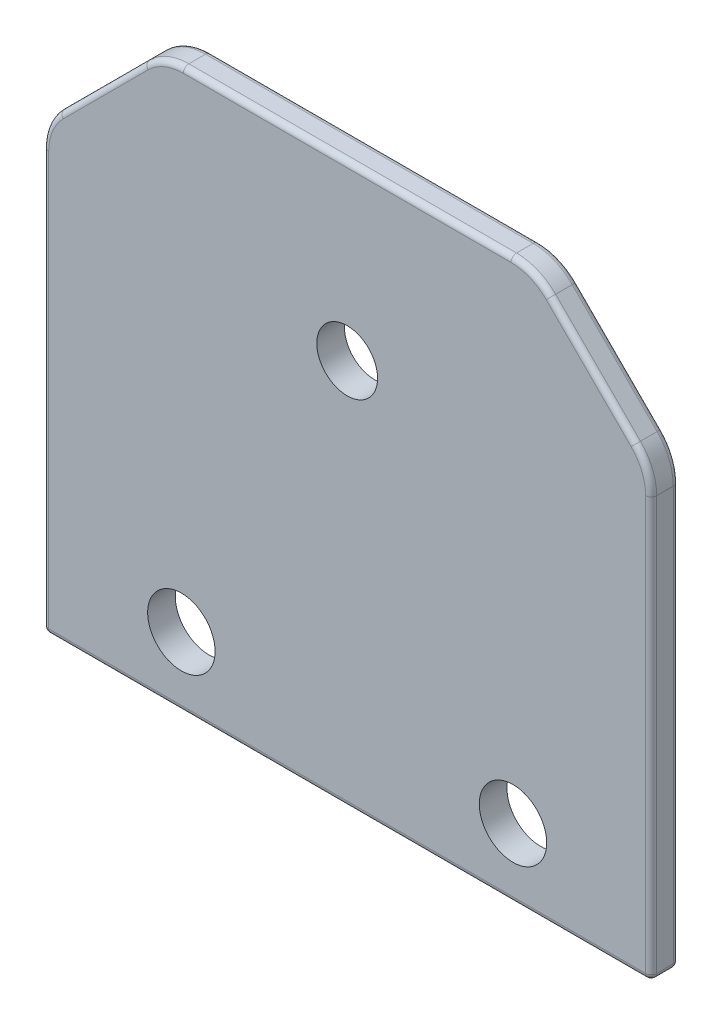
ISO-10303-21;
HEADER;
FILE_DESCRIPTION(('STEP AP214'),'2;1');
FILE_NAME('part.step','',(''),(''),'','','');
FILE_SCHEMA(('AUTOMOTIVE_DESIGN { 1 0 10303 214 1 1 1 1 }'));
ENDSEC;
DATA;
#1=APPLICATION_CONTEXT('core data for automotive mechanical design processes');
#2=APPLICATION_PROTOCOL_DEFINITION('international standard','automotive_design',2000,#1);
#3=PRODUCT_CONTEXT('',#1,'mechanical');
#4=PRODUCT('Part','Part','',(#3));
#5=PRODUCT_RELATED_PRODUCT_CATEGORY('part','',(#4));
#6=PRODUCT_DEFINITION_FORMATION('','',#4);
#7=PRODUCT_DEFINITION_CONTEXT('part definition',#1,'design');
#8=PRODUCT_DEFINITION('design','',#6,#7);
#9=PRODUCT_DEFINITION_SHAPE('','',#8);
#10=(LENGTH_UNIT() NAMED_UNIT(*) SI_UNIT(.MILLI.,.METRE.));
#11=(NAMED_UNIT(*) PLANE_ANGLE_UNIT() SI_UNIT($,.RADIAN.));
#12=(NAMED_UNIT(*) SI_UNIT($,.STERADIAN.) SOLID_ANGLE_UNIT());
#13=UNCERTAINTY_MEASURE_WITH_UNIT(LENGTH_MEASURE(1.E-05),#10,'distance_accuracy_value','');
#14=(GEOMETRIC_REPRESENTATION_CONTEXT(3) GLOBAL_UNCERTAINTY_ASSIGNED_CONTEXT((#13)) GLOBAL_UNIT_ASSIGNED_CONTEXT((#10,
#11,#12)) REPRESENTATION_CONTEXT('',''));
#15=CARTESIAN_POINT('',(0.,0.,0.));
#16=DIRECTION('',(0.,0.,1.));
#17=DIRECTION('',(1.,0.,0.));
#18=AXIS2_PLACEMENT_3D('',#15,#16,#17);
#19=CARTESIAN_POINT('',(94.9999999999994,95.0000000000005,5.));
#20=DIRECTION('',(-0.707106781186543,-0.707106781186552,0.));
#21=DIRECTION('',(0.707106781186552,-0.707106781186543,0.));
#22=AXIS2_PLACEMENT_3D('',#19,#20,#21);
#23=PLANE('',#22);
#24=DIRECTION('',(0.,0.,-1.));
#25=VECTOR('',#24,1.);
#26=CARTESIAN_POINT('',(107.071067811865,82.9289321881345,5.));
#27=LINE('',#26,#25);
#28=CARTESIAN_POINT('',(107.071067811865,82.9289321881345,4.));
#29=VERTEX_POINT('',#28);
#30=CARTESIAN_POINT('',(107.071067811865,82.9289321881345,1.));
#31=VERTEX_POINT('',#30);
#32=EDGE_CURVE('E234',#29,#31,#27,.T.);
#33=ORIENTED_EDGE('',*,*,#32,.T.);
#34=DIRECTION('',(-0.707106781186552,0.707106781186543,0.));
#35=VECTOR('',#34,1.);
#36=CARTESIAN_POINT('',(94.9999999999994,95.0000000000005,1.));
#37=LINE('',#36,#35);
#38=CARTESIAN_POINT('',(91.7157287525378,98.284271247462,1.));
#39=VERTEX_POINT('',#38);
#40=EDGE_CURVE('E276',#31,#39,#37,.T.);
#41=ORIENTED_EDGE('',*,*,#40,.T.);
#42=DIRECTION('',(0.,0.,-1.));
#43=VECTOR('',#42,1.);
#44=CARTESIAN_POINT('',(91.7157287525378,98.284271247462,5.));
#45=LINE('',#44,#43);
#46=CARTESIAN_POINT('',(91.7157287525378,98.284271247462,4.));
#47=VERTEX_POINT('',#46);
#48=EDGE_CURVE('E239',#39,#47,#45,.F.);
#49=ORIENTED_EDGE('',*,*,#48,.T.);
#50=DIRECTION('',(-0.707106781186552,0.707106781186543,0.));
#51=VECTOR('',#50,1.);
#52=CARTESIAN_POINT('',(107.071067811865,82.9289321881345,4.));
#53=LINE('',#52,#51);
#54=EDGE_CURVE('E218',#47,#29,#53,.F.);
#55=ORIENTED_EDGE('',*,*,#54,.T.);
#56=EDGE_LOOP('',(#33,#41,#49,#55));
#57=FACE_BOUND('',#56,.T.);
#58=ADVANCED_FACE('F45',(#57),#23,.F.);
#59=CARTESIAN_POINT('',(0.,101.213203435596,5.));
#60=DIRECTION('',(0.,-1.,0.));
#61=DIRECTION('',(1.,0.,0.));
#62=AXIS2_PLACEMENT_3D('',#59,#60,#61);
#63=PLANE('',#62);
#64=DIRECTION('',(0.,0.,-1.));
#65=VECTOR('',#64,1.);
#66=CARTESIAN_POINT('',(84.6446609406724,101.213203435596,5.));
#67=LINE('',#66,#65);
#68=CARTESIAN_POINT('',(84.6446609406724,101.213203435596,4.));
#69=VERTEX_POINT('',#68);
#70=CARTESIAN_POINT('',(84.6446609406724,101.213203435596,1.));
#71=VERTEX_POINT('',#70);
#72=EDGE_CURVE('E237',#69,#71,#67,.T.);
#73=ORIENTED_EDGE('',*,*,#72,.T.);
#74=DIRECTION('',(-1.,0.,0.));
#75=VECTOR('',#74,1.);
#76=CARTESIAN_POINT('',(0.,101.213203435596,1.));
#77=LINE('',#76,#75);
#78=CARTESIAN_POINT('',(25.3553390593273,101.213203435596,1.));
#79=VERTEX_POINT('',#78);
#80=EDGE_CURVE('E11',#71,#79,#77,.T.);
#81=ORIENTED_EDGE('',*,*,#80,.T.);
#82=DIRECTION('',(0.,0.,-1.));
#83=VECTOR('',#82,1.);
#84=CARTESIAN_POINT('',(25.3553390593273,101.213203435596,5.));
#85=LINE('',#84,#83);
#86=CARTESIAN_POINT('',(25.3553390593273,101.213203435596,4.));
#87=VERTEX_POINT('',#86);
#88=EDGE_CURVE('E233',#79,#87,#85,.F.);
#89=ORIENTED_EDGE('',*,*,#88,.T.);
#90=DIRECTION('',(-1.,0.,0.));
#91=VECTOR('',#90,1.);
#92=CARTESIAN_POINT('',(84.6446609406724,101.213203435596,4.));
#93=LINE('',#92,#91);
#94=EDGE_CURVE('E54',#87,#69,#93,.F.);
#95=ORIENTED_EDGE('',*,*,#94,.T.);
#96=EDGE_LOOP('',(#73,#81,#89,#95));
#97=FACE_BOUND('',#96,.T.);
#98=ADVANCED_FACE('F455',(#97),#63,.F.);
#99=CARTESIAN_POINT('',(-40.,39.9999999999998,5.));
#100=DIRECTION('',(-0.707106781186549,0.707106781186546,0.));
#101=DIRECTION('',(-0.707106781186546,-0.707106781186549,0.));
#102=AXIS2_PLACEMENT_3D('',#99,#100,#101);
#103=PLANE('',#102);
#104=DIRECTION('',(0.,0.,-1.));
#105=VECTOR('',#104,1.);
#106=CARTESIAN_POINT('',(18.2842712474619,98.2842712474619,0.));
#107=LINE('',#106,#105);
#108=CARTESIAN_POINT('',(18.2842712474619,98.2842712474619,4.));
#109=VERTEX_POINT('',#108);
#110=CARTESIAN_POINT('',(18.2842712474619,98.2842712474619,1.));
#111=VERTEX_POINT('',#110);
#112=EDGE_CURVE('E248',#109,#111,#107,.T.);
#113=ORIENTED_EDGE('',*,*,#112,.T.);
#114=DIRECTION('',(0.707106781186546,0.707106781186549,0.));
#115=VECTOR('',#114,1.);
#116=CARTESIAN_POINT('',(2.92893218813452,82.9289321881345,1.));
#117=LINE('',#116,#115);
#118=CARTESIAN_POINT('',(2.92893218813452,82.9289321881345,1.));
#119=VERTEX_POINT('',#118);
#120=EDGE_CURVE('E294',#111,#119,#117,.F.);
#121=ORIENTED_EDGE('',*,*,#120,.T.);
#122=DIRECTION('',(0.,0.,-1.));
#123=VECTOR('',#122,1.);
#124=CARTESIAN_POINT('',(2.92893218813452,82.9289321881345,5.));
#125=LINE('',#124,#123);
#126=CARTESIAN_POINT('',(2.92893218813452,82.9289321881345,4.));
#127=VERTEX_POINT('',#126);
#128=EDGE_CURVE('E251',#119,#127,#125,.F.);
#129=ORIENTED_EDGE('',*,*,#128,.T.);
#130=DIRECTION('',(0.707106781186546,0.707106781186549,0.));
#131=VECTOR('',#130,1.);
#132=CARTESIAN_POINT('',(-40.,39.9999999999998,4.));
#133=LINE('',#132,#131);
#134=EDGE_CURVE('E292',#127,#109,#133,.T.);
#135=ORIENTED_EDGE('',*,*,#134,.T.);
#136=EDGE_LOOP('',(#113,#121,#129,#135));
#137=FACE_BOUND('',#136,.T.);
#138=ADVANCED_FACE('F460',(#137),#103,.T.);
#139=CARTESIAN_POINT('',(0.,0.,5.));
#140=DIRECTION('',(-1.,0.,0.));
#141=DIRECTION('',(0.,-1.,0.));
#142=AXIS2_PLACEMENT_3D('',#139,#140,#141);
#143=PLANE('',#142);
#144=DIRECTION('',(0.,0.,-1.));
#145=VECTOR('',#144,1.);
#146=CARTESIAN_POINT('',(0.,75.8578643762691,5.));
#147=LINE('',#146,#145);
#148=CARTESIAN_POINT('',(0.,75.8578643762691,4.));
#149=VERTEX_POINT('',#148);
#150=CARTESIAN_POINT('',(0.,75.8578643762691,1.));
#151=VERTEX_POINT('',#150);
#152=EDGE_CURVE('E245',#149,#151,#147,.T.);
#153=ORIENTED_EDGE('',*,*,#152,.T.);
#154=DIRECTION('',(0.,1.,0.));
#155=VECTOR('',#154,1.);
#156=CARTESIAN_POINT('',(0.,0.,1.));
#157=LINE('',#156,#155);
#158=CARTESIAN_POINT('',(0.,1.,1.));
#159=VERTEX_POINT('',#158);
#160=EDGE_CURVE('E286',#151,#159,#157,.F.);
#161=ORIENTED_EDGE('',*,*,#160,.T.);
#162=DIRECTION('',(0.,0.,-1.));
#163=VECTOR('',#162,1.);
#164=CARTESIAN_POINT('',(0.,1.,5.));
#165=LINE('',#164,#163);
#166=CARTESIAN_POINT('',(0.,1.,4.));
#167=VERTEX_POINT('',#166);
#168=EDGE_CURVE('E282',#159,#167,#165,.F.);
#169=ORIENTED_EDGE('',*,*,#168,.T.);
#170=DIRECTION('',(0.,1.,0.));
#171=VECTOR('',#170,1.);
#172=CARTESIAN_POINT('',(0.,0.,4.));
#173=LINE('',#172,#171);
#174=EDGE_CURVE('E284',#167,#149,#173,.T.);
#175=ORIENTED_EDGE('',*,*,#174,.T.);
#176=EDGE_LOOP('',(#153,#161,#169,#175));
#177=FACE_BOUND('',#176,.T.);
#178=ADVANCED_FACE('F635',(#177),#143,.T.);
#179=CARTESIAN_POINT('',(0.,0.,5.));
#180=DIRECTION('',(0.,1.,0.));
#181=DIRECTION('',(0.,0.,1.));
#182=AXIS2_PLACEMENT_3D('',#179,#180,#181);
#183=PLANE('',#182);
#184=DIRECTION('',(1.,0.,0.));
#185=VECTOR('',#184,1.);
#186=CARTESIAN_POINT('',(0.,0.,1.));
#187=LINE('',#186,#185);
#188=CARTESIAN_POINT('',(1.,0.,1.));
#189=VERTEX_POINT('',#188);
#190=CARTESIAN_POINT('',(109.,0.,1.));
#191=VERTEX_POINT('',#190);
#192=EDGE_CURVE('E62',#189,#191,#187,.T.);
#193=ORIENTED_EDGE('',*,*,#192,.T.);
#194=DIRECTION('',(0.,0.,-1.));
#195=VECTOR('',#194,1.);
#196=CARTESIAN_POINT('',(109.,0.,5.));
#197=LINE('',#196,#195);
#198=CARTESIAN_POINT('',(109.,0.,4.));
#199=VERTEX_POINT('',#198);
#200=EDGE_CURVE('E326',#191,#199,#197,.F.);
#201=ORIENTED_EDGE('',*,*,#200,.T.);
#202=DIRECTION('',(1.,0.,0.));
#203=VECTOR('',#202,1.);
#204=CARTESIAN_POINT('',(0.,0.,4.));
#205=LINE('',#204,#203);
#206=CARTESIAN_POINT('',(1.,0.,4.));
#207=VERTEX_POINT('',#206);
#208=EDGE_CURVE('E323',#199,#207,#205,.F.);
#209=ORIENTED_EDGE('',*,*,#208,.T.);
#210=DIRECTION('',(0.,0.,-1.));
#211=VECTOR('',#210,1.);
#212=CARTESIAN_POINT('',(1.,0.,0.));
#213=LINE('',#212,#211);
#214=EDGE_CURVE('E321',#207,#189,#213,.T.);
#215=ORIENTED_EDGE('',*,*,#214,.T.);
#216=EDGE_LOOP('',(#193,#201,#209,#215));
#217=FACE_BOUND('',#216,.T.);
#218=ADVANCED_FACE('F637',(#217),#183,.F.);
#219=CARTESIAN_POINT('',(25.,12.5,5.));
#220=DIRECTION('',(0.,0.,-1.));
#221=DIRECTION('',(-1.,0.,0.));
#222=AXIS2_PLACEMENT_3D('',#219,#220,#221);
#223=CYLINDRICAL_SURFACE('',#222,6.1);
#224=CARTESIAN_POINT('',(25.,12.5,5.));
#225=DIRECTION('',(0.,0.,1.));
#226=DIRECTION('',(1.,0.,0.));
#227=AXIS2_PLACEMENT_3D('',#224,#225,#226);
#228=CIRCLE('',#227,6.1);
#229=CARTESIAN_POINT('',(31.1,12.5,5.));
#230=VERTEX_POINT('',#229);
#231=EDGE_CURVE('E426',#230,#230,#228,.T.);
#232=ORIENTED_EDGE('',*,*,#231,.T.);
#233=EDGE_LOOP('',(#232));
#234=FACE_BOUND('',#233,.T.);
#235=CARTESIAN_POINT('',(25.,12.5,0.));
#236=DIRECTION('',(0.,0.,1.));
#237=DIRECTION('',(1.,0.,0.));
#238=AXIS2_PLACEMENT_3D('',#235,#236,#237);
#239=CIRCLE('',#238,6.1);
#240=CARTESIAN_POINT('',(31.1,12.5,0.));
#241=VERTEX_POINT('',#240);
#242=EDGE_CURVE('E408',#241,#241,#239,.T.);
#243=ORIENTED_EDGE('',*,*,#242,.F.);
#244=EDGE_LOOP('',(#243));
#245=FACE_BOUND('',#244,.T.);
#246=ADVANCED_FACE('F643',(#234,#245),#223,.F.);
#247=CARTESIAN_POINT('',(85.,12.5,5.));
#248=DIRECTION('',(0.,0.,-1.));
#249=DIRECTION('',(-1.,0.,0.));
#250=AXIS2_PLACEMENT_3D('',#247,#248,#249);
#251=CYLINDRICAL_SURFACE('',#250,6.1);
#252=CARTESIAN_POINT('',(85.,12.5,5.));
#253=DIRECTION('',(0.,0.,1.));
#254=DIRECTION('',(1.,0.,0.));
#255=AXIS2_PLACEMENT_3D('',#252,#253,#254);
#256=CIRCLE('',#255,6.1);
#257=CARTESIAN_POINT('',(91.1,12.5,5.));
#258=VERTEX_POINT('',#257);
#259=EDGE_CURVE('E420',#258,#258,#256,.T.);
#260=ORIENTED_EDGE('',*,*,#259,.T.);
#261=EDGE_LOOP('',(#260));
#262=FACE_BOUND('',#261,.T.);
#263=CARTESIAN_POINT('',(85.,12.5,0.));
#264=DIRECTION('',(0.,0.,1.));
#265=DIRECTION('',(1.,0.,0.));
#266=AXIS2_PLACEMENT_3D('',#263,#264,#265);
#267=CIRCLE('',#266,6.1);
#268=CARTESIAN_POINT('',(91.1,12.5,0.));
#269=VERTEX_POINT('',#268);
#270=EDGE_CURVE('E402',#269,#269,#267,.T.);
#271=ORIENTED_EDGE('',*,*,#270,.F.);
#272=EDGE_LOOP('',(#271));
#273=FACE_BOUND('',#272,.T.);
#274=ADVANCED_FACE('F436',(#262,#273),#251,.F.);
#275=CARTESIAN_POINT('',(110.,0.,5.));
#276=DIRECTION('',(-1.,0.,0.));
#277=DIRECTION('',(0.,0.,1.));
#278=AXIS2_PLACEMENT_3D('',#275,#276,#277);
#279=PLANE('',#278);
#280=DIRECTION('',(0.,0.,-1.));
#281=VECTOR('',#280,1.);
#282=CARTESIAN_POINT('',(110.,1.,5.));
#283=LINE('',#282,#281);
#284=CARTESIAN_POINT('',(110.,1.,4.));
#285=VERTEX_POINT('',#284);
#286=CARTESIAN_POINT('',(110.,1.,1.));
#287=VERTEX_POINT('',#286);
#288=EDGE_CURVE('E226',#285,#287,#283,.T.);
#289=ORIENTED_EDGE('',*,*,#288,.T.);
#290=DIRECTION('',(0.,1.,0.));
#291=VECTOR('',#290,1.);
#292=CARTESIAN_POINT('',(110.,0.,1.));
#293=LINE('',#292,#291);
#294=CARTESIAN_POINT('',(110.,75.857864376269,1.));
#295=VERTEX_POINT('',#294);
#296=EDGE_CURVE('E202',#287,#295,#293,.T.);
#297=ORIENTED_EDGE('',*,*,#296,.T.);
#298=DIRECTION('',(0.,0.,-1.));
#299=VECTOR('',#298,1.);
#300=CARTESIAN_POINT('',(110.,75.857864376269,5.));
#301=LINE('',#300,#299);
#302=CARTESIAN_POINT('',(110.,75.857864376269,4.));
#303=VERTEX_POINT('',#302);
#304=EDGE_CURVE('E224',#295,#303,#301,.F.);
#305=ORIENTED_EDGE('',*,*,#304,.T.);
#306=DIRECTION('',(0.,1.,0.));
#307=VECTOR('',#306,1.);
#308=CARTESIAN_POINT('',(110.,0.,4.));
#309=LINE('',#308,#307);
#310=EDGE_CURVE('E229',#303,#285,#309,.F.);
#311=ORIENTED_EDGE('',*,*,#310,.T.);
#312=EDGE_LOOP('',(#289,#297,#305,#311));
#313=FACE_BOUND('',#312,.T.);
#314=ADVANCED_FACE('F223',(#313),#279,.F.);
#315=CARTESIAN_POINT('',(55.,70.,5.));
#316=DIRECTION('',(0.,0.,-1.));
#317=DIRECTION('',(-1.,0.,0.));
#318=AXIS2_PLACEMENT_3D('',#315,#316,#317);
#319=CYLINDRICAL_SURFACE('',#318,5.5);
#320=CARTESIAN_POINT('',(55.,70.,5.));
#321=DIRECTION('',(0.,0.,1.));
#322=DIRECTION('',(1.,0.,0.));
#323=AXIS2_PLACEMENT_3D('',#320,#321,#322);
#324=CIRCLE('',#323,5.5);
#325=CARTESIAN_POINT('',(60.5,70.,5.));
#326=VERTEX_POINT('',#325);
#327=EDGE_CURVE('E416',#326,#326,#324,.T.);
#328=ORIENTED_EDGE('',*,*,#327,.T.);
#329=EDGE_LOOP('',(#328));
#330=FACE_BOUND('',#329,.T.);
#331=CARTESIAN_POINT('',(55.,70.,0.));
#332=DIRECTION('',(0.,0.,1.));
#333=DIRECTION('',(1.,0.,0.));
#334=AXIS2_PLACEMENT_3D('',#331,#332,#333);
#335=CIRCLE('',#334,5.5);
#336=CARTESIAN_POINT('',(60.5,70.,0.));
#337=VERTEX_POINT('',#336);
#338=EDGE_CURVE('E413',#337,#337,#335,.T.);
#339=ORIENTED_EDGE('',*,*,#338,.F.);
#340=EDGE_LOOP('',(#339));
#341=FACE_BOUND('',#340,.T.);
#342=ADVANCED_FACE('F443',(#330,#341),#319,.F.);
#343=CARTESIAN_POINT('',(0.,0.,5.));
#344=DIRECTION('',(0.,0.,1.));
#345=DIRECTION('',(1.,0.,0.));
#346=AXIS2_PLACEMENT_3D('',#343,#344,#345);
#347=PLANE('',#346);
#348=DIRECTION('',(0.,1.,0.));
#349=VECTOR('',#348,1.);
#350=CARTESIAN_POINT('',(1.,0.,5.));
#351=LINE('',#350,#349);
#352=CARTESIAN_POINT('',(1.,75.8578643762691,5.));
#353=VERTEX_POINT('',#352);
#354=CARTESIAN_POINT('',(1.,1.,5.));
#355=VERTEX_POINT('',#354);
#356=EDGE_CURVE('E308',#353,#355,#351,.F.);
#357=ORIENTED_EDGE('',*,*,#356,.T.);
#358=DIRECTION('',(1.,0.,0.));
#359=VECTOR('',#358,1.);
#360=CARTESIAN_POINT('',(110.,1.,5.));
#361=LINE('',#360,#359);
#362=CARTESIAN_POINT('',(109.,1.,5.));
#363=VERTEX_POINT('',#362);
#364=EDGE_CURVE('E319',#355,#363,#361,.T.);
#365=ORIENTED_EDGE('',*,*,#364,.T.);
#366=DIRECTION('',(0.,1.,0.));
#367=VECTOR('',#366,1.);
#368=CARTESIAN_POINT('',(109.,75.857864376269,5.));
#369=LINE('',#368,#367);
#370=CARTESIAN_POINT('',(109.,75.857864376269,5.));
#371=VERTEX_POINT('',#370);
#372=EDGE_CURVE('E316',#363,#371,#369,.T.);
#373=ORIENTED_EDGE('',*,*,#372,.T.);
#374=CARTESIAN_POINT('',(100.,75.857864376269,5.));
#375=DIRECTION('',(0.,0.,1.));
#376=DIRECTION('',(1.,0.,0.));
#377=AXIS2_PLACEMENT_3D('',#374,#375,#376);
#378=CIRCLE('',#377,9.);
#379=CARTESIAN_POINT('',(106.363961030679,82.221825406948,5.));
#380=VERTEX_POINT('',#379);
#381=EDGE_CURVE('E314',#371,#380,#378,.T.);
#382=ORIENTED_EDGE('',*,*,#381,.T.);
#383=DIRECTION('',(-0.707106781186552,0.707106781186543,0.));
#384=VECTOR('',#383,1.);
#385=CARTESIAN_POINT('',(91.0086219713513,97.5771644662755,5.));
#386=LINE('',#385,#384);
#387=CARTESIAN_POINT('',(91.0086219713513,97.5771644662755,5.));
#388=VERTEX_POINT('',#387);
#389=EDGE_CURVE('E312',#380,#388,#386,.T.);
#390=ORIENTED_EDGE('',*,*,#389,.T.);
#391=CARTESIAN_POINT('',(84.6446609406724,91.2132034355965,5.));
#392=DIRECTION('',(0.,0.,1.));
#393=DIRECTION('',(1.,0.,0.));
#394=AXIS2_PLACEMENT_3D('',#391,#392,#393);
#395=CIRCLE('',#394,9.);
#396=CARTESIAN_POINT('',(84.6446609406724,100.213203435596,5.));
#397=VERTEX_POINT('',#396);
#398=EDGE_CURVE('E310',#388,#397,#395,.T.);
#399=ORIENTED_EDGE('',*,*,#398,.T.);
#400=DIRECTION('',(-1.,0.,0.));
#401=VECTOR('',#400,1.);
#402=CARTESIAN_POINT('',(25.3553390593273,100.213203435596,5.));
#403=LINE('',#402,#401);
#404=CARTESIAN_POINT('',(25.3553390593273,100.213203435596,5.));
#405=VERTEX_POINT('',#404);
#406=EDGE_CURVE('E300',#397,#405,#403,.T.);
#407=ORIENTED_EDGE('',*,*,#406,.T.);
#408=CARTESIAN_POINT('',(25.3553390593274,91.2132034355965,5.));
#409=DIRECTION('',(0.,0.,1.));
#410=DIRECTION('',(1.,0.,0.));
#411=AXIS2_PLACEMENT_3D('',#408,#409,#410);
#412=CIRCLE('',#411,9.);
#413=CARTESIAN_POINT('',(18.9913780286484,97.5771644662754,5.));
#414=VERTEX_POINT('',#413);
#415=EDGE_CURVE('E302',#405,#414,#412,.T.);
#416=ORIENTED_EDGE('',*,*,#415,.T.);
#417=DIRECTION('',(0.707106781186546,0.707106781186549,0.));
#418=VECTOR('',#417,1.);
#419=CARTESIAN_POINT('',(-39.2928932188134,39.2928932188133,5.));
#420=LINE('',#419,#418);
#421=CARTESIAN_POINT('',(3.63603896932107,82.221825406948,5.));
#422=VERTEX_POINT('',#421);
#423=EDGE_CURVE('E304',#414,#422,#420,.F.);
#424=ORIENTED_EDGE('',*,*,#423,.T.);
#425=CARTESIAN_POINT('',(10.,75.8578643762691,5.));
#426=DIRECTION('',(0.,0.,1.));
#427=DIRECTION('',(1.,0.,0.));
#428=AXIS2_PLACEMENT_3D('',#425,#426,#427);
#429=CIRCLE('',#428,9.);
#430=EDGE_CURVE('E306',#422,#353,#429,.T.);
#431=ORIENTED_EDGE('',*,*,#430,.T.);
#432=EDGE_LOOP('',(#357,#365,#373,#382,#390,#399,#407,#416,#424,#431));
#433=FACE_BOUND('',#432,.T.);
#434=ORIENTED_EDGE('',*,*,#259,.F.);
#435=EDGE_LOOP('',(#434));
#436=FACE_BOUND('',#435,.T.);
#437=ORIENTED_EDGE('',*,*,#231,.F.);
#438=EDGE_LOOP('',(#437));
#439=FACE_BOUND('',#438,.T.);
#440=ORIENTED_EDGE('',*,*,#327,.F.);
#441=EDGE_LOOP('',(#440));
#442=FACE_BOUND('',#441,.T.);
#443=ADVANCED_FACE('F439',(#433,#436,#439,#442),#347,.T.);
#444=CARTESIAN_POINT('',(0.,0.,0.));
#445=DIRECTION('',(0.,0.,1.));
#446=DIRECTION('',(1.,0.,0.));
#447=AXIS2_PLACEMENT_3D('',#444,#445,#446);
#448=PLANE('',#447);
#449=DIRECTION('',(0.,1.,0.));
#450=VECTOR('',#449,1.);
#451=CARTESIAN_POINT('',(109.,0.,0.));
#452=LINE('',#451,#450);
#453=CARTESIAN_POINT('',(109.,75.857864376269,0.));
#454=VERTEX_POINT('',#453);
#455=CARTESIAN_POINT('',(109.,1.,0.));
#456=VERTEX_POINT('',#455);
#457=EDGE_CURVE('E204',#454,#456,#452,.F.);
#458=ORIENTED_EDGE('',*,*,#457,.T.);
#459=DIRECTION('',(1.,0.,0.));
#460=VECTOR('',#459,1.);
#461=CARTESIAN_POINT('',(0.,1.,0.));
#462=LINE('',#461,#460);
#463=CARTESIAN_POINT('',(1.,1.,0.));
#464=VERTEX_POINT('',#463);
#465=EDGE_CURVE('E272',#456,#464,#462,.F.);
#466=ORIENTED_EDGE('',*,*,#465,.T.);
#467=DIRECTION('',(0.,1.,0.));
#468=VECTOR('',#467,1.);
#469=CARTESIAN_POINT('',(1.,75.8578643762691,0.));
#470=LINE('',#469,#468);
#471=CARTESIAN_POINT('',(1.,75.8578643762691,0.));
#472=VERTEX_POINT('',#471);
#473=EDGE_CURVE('E263',#464,#472,#470,.T.);
#474=ORIENTED_EDGE('',*,*,#473,.T.);
#475=CARTESIAN_POINT('',(10.,75.8578643762691,0.));
#476=DIRECTION('',(0.,0.,1.));
#477=DIRECTION('',(1.,0.,0.));
#478=AXIS2_PLACEMENT_3D('',#475,#476,#477);
#479=CIRCLE('',#478,9.);
#480=CARTESIAN_POINT('',(3.63603896932108,82.221825406948,0.));
#481=VERTEX_POINT('',#480);
#482=EDGE_CURVE('E261',#472,#481,#479,.F.);
#483=ORIENTED_EDGE('',*,*,#482,.T.);
#484=DIRECTION('',(0.707106781186546,0.707106781186549,0.));
#485=VECTOR('',#484,1.);
#486=CARTESIAN_POINT('',(18.9913780286484,97.5771644662754,0.));
#487=LINE('',#486,#485);
#488=CARTESIAN_POINT('',(18.9913780286484,97.5771644662754,0.));
#489=VERTEX_POINT('',#488);
#490=EDGE_CURVE('E259',#481,#489,#487,.T.);
#491=ORIENTED_EDGE('',*,*,#490,.T.);
#492=CARTESIAN_POINT('',(25.3553390593274,91.2132034355965,0.));
#493=DIRECTION('',(0.,0.,1.));
#494=DIRECTION('',(1.,0.,0.));
#495=AXIS2_PLACEMENT_3D('',#492,#493,#494);
#496=CIRCLE('',#495,9.);
#497=CARTESIAN_POINT('',(25.3553390593273,100.213203435596,0.));
#498=VERTEX_POINT('',#497);
#499=EDGE_CURVE('E257',#489,#498,#496,.F.);
#500=ORIENTED_EDGE('',*,*,#499,.T.);
#501=DIRECTION('',(-1.,0.,0.));
#502=VECTOR('',#501,1.);
#503=CARTESIAN_POINT('',(0.,100.213203435596,0.));
#504=LINE('',#503,#502);
#505=CARTESIAN_POINT('',(84.6446609406724,100.213203435596,0.));
#506=VERTEX_POINT('',#505);
#507=EDGE_CURVE('E228',#498,#506,#504,.F.);
#508=ORIENTED_EDGE('',*,*,#507,.T.);
#509=CARTESIAN_POINT('',(84.6446609406724,91.2132034355965,0.));
#510=DIRECTION('',(0.,0.,1.));
#511=DIRECTION('',(1.,0.,0.));
#512=AXIS2_PLACEMENT_3D('',#509,#510,#511);
#513=CIRCLE('',#512,9.);
#514=CARTESIAN_POINT('',(91.0086219713513,97.5771644662755,0.));
#515=VERTEX_POINT('',#514);
#516=EDGE_CURVE('E265',#506,#515,#513,.F.);
#517=ORIENTED_EDGE('',*,*,#516,.T.);
#518=DIRECTION('',(-0.707106781186552,0.707106781186543,0.));
#519=VECTOR('',#518,1.);
#520=CARTESIAN_POINT('',(94.2928932188128,94.2928932188139,0.));
#521=LINE('',#520,#519);
#522=CARTESIAN_POINT('',(106.363961030679,82.221825406948,0.));
#523=VERTEX_POINT('',#522);
#524=EDGE_CURVE('E267',#515,#523,#521,.F.);
#525=ORIENTED_EDGE('',*,*,#524,.T.);
#526=CARTESIAN_POINT('',(100.,75.857864376269,0.));
#527=DIRECTION('',(0.,0.,1.));
#528=DIRECTION('',(1.,0.,0.));
#529=AXIS2_PLACEMENT_3D('',#526,#527,#528);
#530=CIRCLE('',#529,9.);
#531=EDGE_CURVE('E269',#523,#454,#530,.F.);
#532=ORIENTED_EDGE('',*,*,#531,.T.);
#533=EDGE_LOOP('',(#458,#466,#474,#483,#491,#500,#508,#517,#525,#532));
#534=FACE_BOUND('',#533,.T.);
#535=ORIENTED_EDGE('',*,*,#270,.T.);
#536=EDGE_LOOP('',(#535));
#537=FACE_BOUND('',#536,.T.);
#538=ORIENTED_EDGE('',*,*,#242,.T.);
#539=EDGE_LOOP('',(#538));
#540=FACE_BOUND('',#539,.T.);
#541=ORIENTED_EDGE('',*,*,#338,.T.);
#542=EDGE_LOOP('',(#541));
#543=FACE_BOUND('',#542,.T.);
#544=ADVANCED_FACE('F442',(#534,#537,#540,#543),#448,.F.);
#545=CARTESIAN_POINT('',(100.,75.857864376269,5.));
#546=DIRECTION('',(0.,0.,-1.));
#547=DIRECTION('',(-1.,0.,0.));
#548=AXIS2_PLACEMENT_3D('',#545,#546,#547);
#549=CYLINDRICAL_SURFACE('',#548,10.);
#550=ORIENTED_EDGE('',*,*,#304,.F.);
#551=CARTESIAN_POINT('',(100.,75.857864376269,1.));
#552=DIRECTION('',(0.,0.,1.));
#553=DIRECTION('',(1.,0.,0.));
#554=AXIS2_PLACEMENT_3D('',#551,#552,#553);
#555=CIRCLE('',#554,10.);
#556=EDGE_CURVE('E210',#295,#31,#555,.T.);
#557=ORIENTED_EDGE('',*,*,#556,.T.);
#558=ORIENTED_EDGE('',*,*,#32,.F.);
#559=CARTESIAN_POINT('',(100.,75.857864376269,4.));
#560=DIRECTION('',(0.,0.,1.));
#561=DIRECTION('',(1.,0.,0.));
#562=AXIS2_PLACEMENT_3D('',#559,#560,#561);
#563=CIRCLE('',#562,10.);
#564=EDGE_CURVE('E219',#29,#303,#563,.F.);
#565=ORIENTED_EDGE('',*,*,#564,.T.);
#566=EDGE_LOOP('',(#550,#557,#558,#565));
#567=FACE_BOUND('',#566,.T.);
#568=ADVANCED_FACE('F231',(#567),#549,.T.);
#569=CARTESIAN_POINT('',(84.6446609406724,91.2132034355965,5.));
#570=DIRECTION('',(0.,0.,-1.));
#571=DIRECTION('',(-1.,0.,0.));
#572=AXIS2_PLACEMENT_3D('',#569,#570,#571);
#573=CYLINDRICAL_SURFACE('',#572,10.);
#574=ORIENTED_EDGE('',*,*,#48,.F.);
#575=CARTESIAN_POINT('',(84.6446609406724,91.2132034355965,1.));
#576=DIRECTION('',(0.,0.,1.));
#577=DIRECTION('',(1.,0.,0.));
#578=AXIS2_PLACEMENT_3D('',#575,#576,#577);
#579=CIRCLE('',#578,10.);
#580=EDGE_CURVE('E280',#39,#71,#579,.T.);
#581=ORIENTED_EDGE('',*,*,#580,.T.);
#582=ORIENTED_EDGE('',*,*,#72,.F.);
#583=CARTESIAN_POINT('',(84.6446609406724,91.2132034355965,4.));
#584=DIRECTION('',(0.,0.,1.));
#585=DIRECTION('',(1.,0.,0.));
#586=AXIS2_PLACEMENT_3D('',#583,#584,#585);
#587=CIRCLE('',#586,10.);
#588=EDGE_CURVE('E278',#69,#47,#587,.F.);
#589=ORIENTED_EDGE('',*,*,#588,.T.);
#590=EDGE_LOOP('',(#574,#581,#582,#589));
#591=FACE_BOUND('',#590,.T.);
#592=ADVANCED_FACE('F467',(#591),#573,.T.);
#593=CARTESIAN_POINT('',(10.,75.8578643762691,5.));
#594=DIRECTION('',(0.,0.,-1.));
#595=DIRECTION('',(-1.,0.,0.));
#596=AXIS2_PLACEMENT_3D('',#593,#594,#595);
#597=CYLINDRICAL_SURFACE('',#596,10.);
#598=ORIENTED_EDGE('',*,*,#128,.F.);
#599=CARTESIAN_POINT('',(10.,75.8578643762691,1.));
#600=DIRECTION('',(0.,0.,1.));
#601=DIRECTION('',(1.,0.,0.));
#602=AXIS2_PLACEMENT_3D('',#599,#600,#601);
#603=CIRCLE('',#602,10.);
#604=EDGE_CURVE('E290',#119,#151,#603,.T.);
#605=ORIENTED_EDGE('',*,*,#604,.T.);
#606=ORIENTED_EDGE('',*,*,#152,.F.);
#607=CARTESIAN_POINT('',(10.,75.8578643762691,4.));
#608=DIRECTION('',(0.,0.,1.));
#609=DIRECTION('',(1.,0.,0.));
#610=AXIS2_PLACEMENT_3D('',#607,#608,#609);
#611=CIRCLE('',#610,10.);
#612=EDGE_CURVE('E288',#149,#127,#611,.F.);
#613=ORIENTED_EDGE('',*,*,#612,.T.);
#614=EDGE_LOOP('',(#598,#605,#606,#613));
#615=FACE_BOUND('',#614,.T.);
#616=ADVANCED_FACE('F470',(#615),#597,.T.);
#617=CARTESIAN_POINT('',(25.3553390593274,91.2132034355965,5.));
#618=DIRECTION('',(0.,0.,1.));
#619=DIRECTION('',(1.,0.,0.));
#620=AXIS2_PLACEMENT_3D('',#617,#618,#619);
#621=CYLINDRICAL_SURFACE('',#620,10.);
#622=ORIENTED_EDGE('',*,*,#88,.F.);
#623=CARTESIAN_POINT('',(25.3553390593274,91.2132034355965,1.));
#624=DIRECTION('',(0.,0.,1.));
#625=DIRECTION('',(1.,0.,0.));
#626=AXIS2_PLACEMENT_3D('',#623,#624,#625);
#627=CIRCLE('',#626,10.);
#628=EDGE_CURVE('E298',#79,#111,#627,.T.);
#629=ORIENTED_EDGE('',*,*,#628,.T.);
#630=ORIENTED_EDGE('',*,*,#112,.F.);
#631=CARTESIAN_POINT('',(25.3553390593274,91.2132034355965,4.));
#632=DIRECTION('',(0.,0.,1.));
#633=DIRECTION('',(1.,0.,0.));
#634=AXIS2_PLACEMENT_3D('',#631,#632,#633);
#635=CIRCLE('',#634,10.);
#636=EDGE_CURVE('E296',#109,#87,#635,.F.);
#637=ORIENTED_EDGE('',*,*,#636,.T.);
#638=EDGE_LOOP('',(#622,#629,#630,#637));
#639=FACE_BOUND('',#638,.T.);
#640=ADVANCED_FACE('F474',(#639),#621,.T.);
#641=CARTESIAN_POINT('',(25.3553390593274,91.2132034355965,4.));
#642=DIRECTION('',(0.,0.,1.));
#643=DIRECTION('',(1.,0.,0.));
#644=AXIS2_PLACEMENT_3D('',#641,#642,#643);
#645=TOROIDAL_SURFACE('',#644,9.,1.);
#646=CARTESIAN_POINT('',(25.3553390593273,100.213203435596,4.));
#647=DIRECTION('',(1.,0.,0.));
#648=DIRECTION('',(0.,0.,-1.));
#649=AXIS2_PLACEMENT_3D('',#646,#647,#648);
#650=CIRCLE('',#649,1.);
#651=EDGE_CURVE('E395',#87,#405,#650,.T.);
#652=ORIENTED_EDGE('',*,*,#651,.F.);
#653=ORIENTED_EDGE('',*,*,#636,.F.);
#654=CARTESIAN_POINT('',(18.9913780286484,97.5771644662754,4.));
#655=DIRECTION('',(-0.707106781186546,-0.707106781186549,0.));
#656=DIRECTION('',(0.707106781186549,-0.707106781186546,0.));
#657=AXIS2_PLACEMENT_3D('',#654,#655,#656);
#658=CIRCLE('',#657,1.);
#659=EDGE_CURVE('E49',#414,#109,#658,.T.);
#660=ORIENTED_EDGE('',*,*,#659,.F.);
#661=ORIENTED_EDGE('',*,*,#415,.F.);
#662=EDGE_LOOP('',(#652,#653,#660,#661));
#663=FACE_BOUND('',#662,.T.);
#664=ADVANCED_FACE('F47',(#663),#645,.T.);
#665=CARTESIAN_POINT('',(-39.2928932188134,39.2928932188133,4.));
#666=DIRECTION('',(0.707106781186546,0.707106781186549,0.));
#667=DIRECTION('',(-0.707106781186549,0.707106781186546,0.));
#668=AXIS2_PLACEMENT_3D('',#665,#666,#667);
#669=CYLINDRICAL_SURFACE('',#668,1.);
#670=ORIENTED_EDGE('',*,*,#659,.T.);
#671=ORIENTED_EDGE('',*,*,#134,.F.);
#672=CARTESIAN_POINT('',(3.63603896932107,82.221825406948,4.));
#673=DIRECTION('',(-0.707106781186544,-0.707106781186551,0.));
#674=DIRECTION('',(0.707106781186551,-0.707106781186544,0.));
#675=AXIS2_PLACEMENT_3D('',#672,#673,#674);
#676=CIRCLE('',#675,1.);
#677=EDGE_CURVE('E393',#422,#127,#676,.T.);
#678=ORIENTED_EDGE('',*,*,#677,.F.);
#679=ORIENTED_EDGE('',*,*,#423,.F.);
#680=EDGE_LOOP('',(#670,#671,#678,#679));
#681=FACE_BOUND('',#680,.T.);
#682=ADVANCED_FACE('F568',(#681),#669,.T.);
#683=CARTESIAN_POINT('',(0.,100.213203435596,4.));
#684=DIRECTION('',(1.,0.,0.));
#685=DIRECTION('',(0.,1.,0.));
#686=AXIS2_PLACEMENT_3D('',#683,#684,#685);
#687=CYLINDRICAL_SURFACE('',#686,1.);
#688=ORIENTED_EDGE('',*,*,#651,.T.);
#689=ORIENTED_EDGE('',*,*,#406,.F.);
#690=CARTESIAN_POINT('',(84.6446609406724,100.213203435596,4.));
#691=DIRECTION('',(1.,0.,0.));
#692=DIRECTION('',(0.,0.,-1.));
#693=AXIS2_PLACEMENT_3D('',#690,#691,#692);
#694=CIRCLE('',#693,1.);
#695=EDGE_CURVE('E390',#69,#397,#694,.T.);
#696=ORIENTED_EDGE('',*,*,#695,.F.);
#697=ORIENTED_EDGE('',*,*,#94,.F.);
#698=EDGE_LOOP('',(#688,#689,#696,#697));
#699=FACE_BOUND('',#698,.T.);
#700=ADVANCED_FACE('F565',(#699),#687,.T.);
#701=CARTESIAN_POINT('',(10.,75.8578643762691,4.));
#702=DIRECTION('',(0.,0.,1.));
#703=DIRECTION('',(1.,0.,0.));
#704=AXIS2_PLACEMENT_3D('',#701,#702,#703);
#705=TOROIDAL_SURFACE('',#704,9.,1.);
#706=ORIENTED_EDGE('',*,*,#677,.T.);
#707=ORIENTED_EDGE('',*,*,#612,.F.);
#708=CARTESIAN_POINT('',(1.,75.8578643762691,4.));
#709=DIRECTION('',(0.,-1.,0.));
#710=DIRECTION('',(0.,0.,-1.));
#711=AXIS2_PLACEMENT_3D('',#708,#709,#710);
#712=CIRCLE('',#711,1.);
#713=EDGE_CURVE('E387',#353,#149,#712,.T.);
#714=ORIENTED_EDGE('',*,*,#713,.F.);
#715=ORIENTED_EDGE('',*,*,#430,.F.);
#716=EDGE_LOOP('',(#706,#707,#714,#715));
#717=FACE_BOUND('',#716,.T.);
#718=ADVANCED_FACE('F561',(#717),#705,.T.);
#719=CARTESIAN_POINT('',(84.6446609406724,91.2132034355965,4.));
#720=DIRECTION('',(0.,0.,1.));
#721=DIRECTION('',(1.,0.,0.));
#722=AXIS2_PLACEMENT_3D('',#719,#720,#721);
#723=TOROIDAL_SURFACE('',#722,9.,1.);
#724=ORIENTED_EDGE('',*,*,#695,.T.);
#725=ORIENTED_EDGE('',*,*,#398,.F.);
#726=CARTESIAN_POINT('',(91.0086219713513,97.5771644662755,4.));
#727=DIRECTION('',(0.707106781186548,-0.707106781186548,0.));
#728=DIRECTION('',(0.707106781186548,0.707106781186548,0.));
#729=AXIS2_PLACEMENT_3D('',#726,#727,#728);
#730=CIRCLE('',#729,1.);
#731=EDGE_CURVE('E384',#47,#388,#730,.T.);
#732=ORIENTED_EDGE('',*,*,#731,.F.);
#733=ORIENTED_EDGE('',*,*,#588,.F.);
#734=EDGE_LOOP('',(#724,#725,#732,#733));
#735=FACE_BOUND('',#734,.T.);
#736=ADVANCED_FACE('F557',(#735),#723,.T.);
#737=CARTESIAN_POINT('',(1.,0.,4.));
#738=DIRECTION('',(0.,1.,0.));
#739=DIRECTION('',(-1.,0.,0.));
#740=AXIS2_PLACEMENT_3D('',#737,#738,#739);
#741=CYLINDRICAL_SURFACE('',#740,1.);
#742=ORIENTED_EDGE('',*,*,#713,.T.);
#743=ORIENTED_EDGE('',*,*,#174,.F.);
#744=CARTESIAN_POINT('',(1.,1.,4.));
#745=DIRECTION('',(0.,-1.,0.));
#746=DIRECTION('',(0.,0.,-1.));
#747=AXIS2_PLACEMENT_3D('',#744,#745,#746);
#748=CIRCLE('',#747,1.);
#749=EDGE_CURVE('E378',#355,#167,#748,.T.);
#750=ORIENTED_EDGE('',*,*,#749,.F.);
#751=ORIENTED_EDGE('',*,*,#356,.F.);
#752=EDGE_LOOP('',(#742,#743,#750,#751));
#753=FACE_BOUND('',#752,.T.);
#754=ADVANCED_FACE('F553',(#753),#741,.T.);
#755=CARTESIAN_POINT('',(94.2928932188128,94.2928932188139,4.));
#756=DIRECTION('',(0.707106781186552,-0.707106781186543,0.));
#757=DIRECTION('',(0.707106781186543,0.707106781186552,0.));
#758=AXIS2_PLACEMENT_3D('',#755,#756,#757);
#759=CYLINDRICAL_SURFACE('',#758,1.);
#760=ORIENTED_EDGE('',*,*,#731,.T.);
#761=ORIENTED_EDGE('',*,*,#389,.F.);
#762=CARTESIAN_POINT('',(106.363961030679,82.221825406948,4.));
#763=DIRECTION('',(0.707106781186548,-0.707106781186548,0.));
#764=DIRECTION('',(0.707106781186548,0.707106781186548,0.));
#765=AXIS2_PLACEMENT_3D('',#762,#763,#764);
#766=CIRCLE('',#765,1.);
#767=EDGE_CURVE('E375',#29,#380,#766,.T.);
#768=ORIENTED_EDGE('',*,*,#767,.F.);
#769=ORIENTED_EDGE('',*,*,#54,.F.);
#770=EDGE_LOOP('',(#760,#761,#768,#769));
#771=FACE_BOUND('',#770,.T.);
#772=ADVANCED_FACE('F549',(#771),#759,.T.);
#773=CARTESIAN_POINT('',(-39.2928932188134,39.2928932188133,1.));
#774=DIRECTION('',(-0.707106781186546,-0.707106781186549,0.));
#775=DIRECTION('',(0.707106781186549,-0.707106781186546,0.));
#776=AXIS2_PLACEMENT_3D('',#773,#774,#775);
#777=CYLINDRICAL_SURFACE('',#776,1.);
#778=CARTESIAN_POINT('',(18.9913780286484,97.5771644662754,1.));
#779=DIRECTION('',(0.707106781186548,0.707106781186548,0.));
#780=DIRECTION('',(-0.707106781186548,0.707106781186548,0.));
#781=AXIS2_PLACEMENT_3D('',#778,#779,#780);
#782=CIRCLE('',#781,1.);
#783=EDGE_CURVE('E372',#489,#111,#782,.T.);
#784=ORIENTED_EDGE('',*,*,#783,.F.);
#785=ORIENTED_EDGE('',*,*,#490,.F.);
#786=CARTESIAN_POINT('',(3.63603896932107,82.221825406948,1.));
#787=DIRECTION('',(-0.707106781186546,-0.707106781186549,0.));
#788=DIRECTION('',(0.707106781186549,-0.707106781186546,0.));
#789=AXIS2_PLACEMENT_3D('',#786,#787,#788);
#790=CIRCLE('',#789,1.);
#791=EDGE_CURVE('E381',#119,#481,#790,.T.);
#792=ORIENTED_EDGE('',*,*,#791,.F.);
#793=ORIENTED_EDGE('',*,*,#120,.F.);
#794=EDGE_LOOP('',(#784,#785,#792,#793));
#795=FACE_BOUND('',#794,.T.);
#796=ADVANCED_FACE('F545',(#795),#777,.T.);
#797=CARTESIAN_POINT('',(10.,75.8578643762691,1.));
#798=DIRECTION('',(0.,0.,1.));
#799=DIRECTION('',(1.,0.,0.));
#800=AXIS2_PLACEMENT_3D('',#797,#798,#799);
#801=TOROIDAL_SURFACE('',#800,9.,1.);
#802=ORIENTED_EDGE('',*,*,#791,.T.);
#803=ORIENTED_EDGE('',*,*,#482,.F.);
#804=CARTESIAN_POINT('',(1.,75.8578643762691,1.));
#805=DIRECTION('',(0.,-1.,0.));
#806=DIRECTION('',(0.,0.,-1.));
#807=AXIS2_PLACEMENT_3D('',#804,#805,#806);
#808=CIRCLE('',#807,1.);
#809=EDGE_CURVE('E369',#151,#472,#808,.T.);
#810=ORIENTED_EDGE('',*,*,#809,.F.);
#811=ORIENTED_EDGE('',*,*,#604,.F.);
#812=EDGE_LOOP('',(#802,#803,#810,#811));
#813=FACE_BOUND('',#812,.T.);
#814=ADVANCED_FACE('F541',(#813),#801,.T.);
#815=CARTESIAN_POINT('',(1.,1.,4.));
#816=DIRECTION('',(-1.,0.,0.));
#817=DIRECTION('',(0.,0.,1.));
#818=AXIS2_PLACEMENT_3D('',#815,#816,#817);
#819=SPHERICAL_SURFACE('',#818,1.);
#820=CARTESIAN_POINT('',(1.,1.,4.));
#821=DIRECTION('',(-1.,0.,0.));
#822=DIRECTION('',(0.,0.,1.));
#823=AXIS2_PLACEMENT_3D('',#820,#821,#822);
#824=CIRCLE('',#823,1.);
#825=EDGE_CURVE('E363',#355,#207,#824,.F.);
#826=ORIENTED_EDGE('',*,*,#825,.F.);
#827=ORIENTED_EDGE('',*,*,#749,.T.);
#828=CARTESIAN_POINT('',(1.,1.,4.));
#829=DIRECTION('',(0.,0.,1.));
#830=DIRECTION('',(1.,0.,0.));
#831=AXIS2_PLACEMENT_3D('',#828,#829,#830);
#832=CIRCLE('',#831,1.);
#833=EDGE_CURVE('E366',#207,#167,#832,.F.);
#834=ORIENTED_EDGE('',*,*,#833,.F.);
#835=EDGE_LOOP('',(#826,#827,#834));
#836=FACE_BOUND('',#835,.T.);
#837=ADVANCED_FACE('F537',(#836),#819,.T.);
#838=CARTESIAN_POINT('',(100.,75.857864376269,4.));
#839=DIRECTION('',(0.,0.,1.));
#840=DIRECTION('',(1.,0.,0.));
#841=AXIS2_PLACEMENT_3D('',#838,#839,#840);
#842=TOROIDAL_SURFACE('',#841,9.,1.);
#843=ORIENTED_EDGE('',*,*,#767,.T.);
#844=ORIENTED_EDGE('',*,*,#381,.F.);
#845=CARTESIAN_POINT('',(109.,75.857864376269,4.));
#846=DIRECTION('',(0.,-1.,0.));
#847=DIRECTION('',(0.,0.,-1.));
#848=AXIS2_PLACEMENT_3D('',#845,#846,#847);
#849=CIRCLE('',#848,1.);
#850=EDGE_CURVE('E361',#303,#371,#849,.T.);
#851=ORIENTED_EDGE('',*,*,#850,.F.);
#852=ORIENTED_EDGE('',*,*,#564,.F.);
#853=EDGE_LOOP('',(#843,#844,#851,#852));
#854=FACE_BOUND('',#853,.T.);
#855=ADVANCED_FACE('F533',(#854),#842,.T.);
#856=CARTESIAN_POINT('',(25.3553390593274,91.2132034355965,1.));
#857=DIRECTION('',(0.,0.,1.));
#858=DIRECTION('',(1.,0.,0.));
#859=AXIS2_PLACEMENT_3D('',#856,#857,#858);
#860=TOROIDAL_SURFACE('',#859,9.,1.);
#861=ORIENTED_EDGE('',*,*,#783,.T.);
#862=ORIENTED_EDGE('',*,*,#628,.F.);
#863=CARTESIAN_POINT('',(25.3553390593273,100.213203435596,1.));
#864=DIRECTION('',(1.,0.,0.));
#865=DIRECTION('',(0.,0.,-1.));
#866=AXIS2_PLACEMENT_3D('',#863,#864,#865);
#867=CIRCLE('',#866,1.);
#868=EDGE_CURVE('E358',#498,#79,#867,.T.);
#869=ORIENTED_EDGE('',*,*,#868,.F.);
#870=ORIENTED_EDGE('',*,*,#499,.F.);
#871=EDGE_LOOP('',(#861,#862,#869,#870));
#872=FACE_BOUND('',#871,.T.);
#873=ADVANCED_FACE('F529',(#872),#860,.T.);
#874=CARTESIAN_POINT('',(1.,0.,1.));
#875=DIRECTION('',(0.,-1.,0.));
#876=DIRECTION('',(1.,0.,0.));
#877=AXIS2_PLACEMENT_3D('',#874,#875,#876);
#878=CYLINDRICAL_SURFACE('',#877,1.);
#879=ORIENTED_EDGE('',*,*,#809,.T.);
#880=ORIENTED_EDGE('',*,*,#473,.F.);
#881=CARTESIAN_POINT('',(1.,1.,1.));
#882=DIRECTION('',(0.,-1.,0.));
#883=DIRECTION('',(0.,0.,-1.));
#884=AXIS2_PLACEMENT_3D('',#881,#882,#883);
#885=CIRCLE('',#884,1.);
#886=EDGE_CURVE('E355',#159,#464,#885,.T.);
#887=ORIENTED_EDGE('',*,*,#886,.F.);
#888=ORIENTED_EDGE('',*,*,#160,.F.);
#889=EDGE_LOOP('',(#879,#880,#887,#888));
#890=FACE_BOUND('',#889,.T.);
#891=ADVANCED_FACE('F525',(#890),#878,.T.);
#892=CARTESIAN_POINT('',(1.,1.,5.));
#893=DIRECTION('',(0.,0.,1.));
#894=DIRECTION('',(1.,0.,0.));
#895=AXIS2_PLACEMENT_3D('',#892,#893,#894);
#896=CYLINDRICAL_SURFACE('',#895,1.);
#897=ORIENTED_EDGE('',*,*,#833,.T.);
#898=ORIENTED_EDGE('',*,*,#168,.F.);
#899=CARTESIAN_POINT('',(1.,1.,1.));
#900=DIRECTION('',(0.,0.,-1.));
#901=DIRECTION('',(-1.,0.,0.));
#902=AXIS2_PLACEMENT_3D('',#899,#900,#901);
#903=CIRCLE('',#902,1.);
#904=EDGE_CURVE('E352',#189,#159,#903,.T.);
#905=ORIENTED_EDGE('',*,*,#904,.F.);
#906=ORIENTED_EDGE('',*,*,#214,.F.);
#907=EDGE_LOOP('',(#897,#898,#905,#906));
#908=FACE_BOUND('',#907,.T.);
#909=ADVANCED_FACE('F521',(#908),#896,.T.);
#910=CARTESIAN_POINT('',(0.,1.,4.));
#911=DIRECTION('',(-1.,0.,0.));
#912=DIRECTION('',(0.,0.,1.));
#913=AXIS2_PLACEMENT_3D('',#910,#911,#912);
#914=CYLINDRICAL_SURFACE('',#913,1.);
#915=ORIENTED_EDGE('',*,*,#825,.T.);
#916=ORIENTED_EDGE('',*,*,#208,.F.);
#917=CARTESIAN_POINT('',(109.,1.,4.));
#918=DIRECTION('',(1.,0.,0.));
#919=DIRECTION('',(0.,0.,-1.));
#920=AXIS2_PLACEMENT_3D('',#917,#918,#919);
#921=CIRCLE('',#920,1.);
#922=EDGE_CURVE('E350',#363,#199,#921,.T.);
#923=ORIENTED_EDGE('',*,*,#922,.F.);
#924=ORIENTED_EDGE('',*,*,#364,.F.);
#925=EDGE_LOOP('',(#915,#916,#923,#924));
#926=FACE_BOUND('',#925,.T.);
#927=ADVANCED_FACE('F517',(#926),#914,.T.);
#928=CARTESIAN_POINT('',(109.,0.,4.));
#929=DIRECTION('',(0.,-1.,0.));
#930=DIRECTION('',(0.,0.,-1.));
#931=AXIS2_PLACEMENT_3D('',#928,#929,#930);
#932=CYLINDRICAL_SURFACE('',#931,1.);
#933=ORIENTED_EDGE('',*,*,#850,.T.);
#934=ORIENTED_EDGE('',*,*,#372,.F.);
#935=CARTESIAN_POINT('',(109.,1.,4.));
#936=DIRECTION('',(0.,-1.,0.));
#937=DIRECTION('',(0.,0.,-1.));
#938=AXIS2_PLACEMENT_3D('',#935,#936,#937);
#939=CIRCLE('',#938,1.);
#940=EDGE_CURVE('E347',#285,#363,#939,.T.);
#941=ORIENTED_EDGE('',*,*,#940,.F.);
#942=ORIENTED_EDGE('',*,*,#310,.F.);
#943=EDGE_LOOP('',(#933,#934,#941,#942));
#944=FACE_BOUND('',#943,.T.);
#945=ADVANCED_FACE('F513',(#944),#932,.T.);
#946=CARTESIAN_POINT('',(0.,100.213203435596,1.));
#947=DIRECTION('',(-1.,0.,0.));
#948=DIRECTION('',(0.,-1.,0.));
#949=AXIS2_PLACEMENT_3D('',#946,#947,#948);
#950=CYLINDRICAL_SURFACE('',#949,1.);
#951=ORIENTED_EDGE('',*,*,#868,.T.);
#952=ORIENTED_EDGE('',*,*,#80,.F.);
#953=CARTESIAN_POINT('',(84.6446609406724,100.213203435596,1.));
#954=DIRECTION('',(1.,0.,0.));
#955=DIRECTION('',(0.,0.,-1.));
#956=AXIS2_PLACEMENT_3D('',#953,#954,#955);
#957=CIRCLE('',#956,1.);
#958=EDGE_CURVE('E344',#506,#71,#957,.T.);
#959=ORIENTED_EDGE('',*,*,#958,.F.);
#960=ORIENTED_EDGE('',*,*,#507,.F.);
#961=EDGE_LOOP('',(#951,#952,#959,#960));
#962=FACE_BOUND('',#961,.T.);
#963=ADVANCED_FACE('F509',(#962),#950,.T.);
#964=CARTESIAN_POINT('',(1.,1.,1.));
#965=DIRECTION('',(-1.,0.,0.));
#966=DIRECTION('',(0.,0.,1.));
#967=AXIS2_PLACEMENT_3D('',#964,#965,#966);
#968=SPHERICAL_SURFACE('',#967,1.);
#969=ORIENTED_EDGE('',*,*,#904,.T.);
#970=ORIENTED_EDGE('',*,*,#886,.T.);
#971=CARTESIAN_POINT('',(1.,1.,1.));
#972=DIRECTION('',(-1.,0.,0.));
#973=DIRECTION('',(0.,0.,1.));
#974=AXIS2_PLACEMENT_3D('',#971,#972,#973);
#975=CIRCLE('',#974,1.);
#976=EDGE_CURVE('E341',#189,#464,#975,.F.);
#977=ORIENTED_EDGE('',*,*,#976,.F.);
#978=EDGE_LOOP('',(#969,#970,#977));
#979=FACE_BOUND('',#978,.T.);
#980=ADVANCED_FACE('F505',(#979),#968,.T.);
#981=CARTESIAN_POINT('',(109.,1.,4.));
#982=DIRECTION('',(0.,0.,1.));
#983=DIRECTION('',(1.,0.,0.));
#984=AXIS2_PLACEMENT_3D('',#981,#982,#983);
#985=SPHERICAL_SURFACE('',#984,1.);
#986=ORIENTED_EDGE('',*,*,#940,.T.);
#987=ORIENTED_EDGE('',*,*,#922,.T.);
#988=CARTESIAN_POINT('',(109.,1.,4.));
#989=DIRECTION('',(0.,0.,1.));
#990=DIRECTION('',(1.,0.,0.));
#991=AXIS2_PLACEMENT_3D('',#988,#989,#990);
#992=CIRCLE('',#991,1.);
#993=EDGE_CURVE('E69',#285,#199,#992,.F.);
#994=ORIENTED_EDGE('',*,*,#993,.F.);
#995=EDGE_LOOP('',(#986,#987,#994));
#996=FACE_BOUND('',#995,.T.);
#997=ADVANCED_FACE('F501',(#996),#985,.T.);
#998=CARTESIAN_POINT('',(84.6446609406724,91.2132034355965,1.));
#999=DIRECTION('',(0.,0.,1.));
#1000=DIRECTION('',(1.,0.,0.));
#1001=AXIS2_PLACEMENT_3D('',#998,#999,#1000);
#1002=TOROIDAL_SURFACE('',#1001,9.,1.);
#1003=ORIENTED_EDGE('',*,*,#958,.T.);
#1004=ORIENTED_EDGE('',*,*,#580,.F.);
#1005=CARTESIAN_POINT('',(91.0086219713513,97.5771644662755,1.));
#1006=DIRECTION('',(0.707106781186548,-0.707106781186548,0.));
#1007=DIRECTION('',(0.707106781186548,0.707106781186548,0.));
#1008=AXIS2_PLACEMENT_3D('',#1005,#1006,#1007);
#1009=CIRCLE('',#1008,1.);
#1010=EDGE_CURVE('E337',#515,#39,#1009,.T.);
#1011=ORIENTED_EDGE('',*,*,#1010,.F.);
#1012=ORIENTED_EDGE('',*,*,#516,.F.);
#1013=EDGE_LOOP('',(#1003,#1004,#1011,#1012));
#1014=FACE_BOUND('',#1013,.T.);
#1015=ADVANCED_FACE('F497',(#1014),#1002,.T.);
#1016=CARTESIAN_POINT('',(0.,1.,1.));
#1017=DIRECTION('',(1.,0.,0.));
#1018=DIRECTION('',(0.,0.,-1.));
#1019=AXIS2_PLACEMENT_3D('',#1016,#1017,#1018);
#1020=CYLINDRICAL_SURFACE('',#1019,1.);
#1021=ORIENTED_EDGE('',*,*,#976,.T.);
#1022=ORIENTED_EDGE('',*,*,#465,.F.);
#1023=CARTESIAN_POINT('',(109.,1.,1.));
#1024=DIRECTION('',(1.,0.,0.));
#1025=DIRECTION('',(0.,0.,-1.));
#1026=AXIS2_PLACEMENT_3D('',#1023,#1024,#1025);
#1027=CIRCLE('',#1026,1.);
#1028=EDGE_CURVE('E334',#191,#456,#1027,.T.);
#1029=ORIENTED_EDGE('',*,*,#1028,.F.);
#1030=ORIENTED_EDGE('',*,*,#192,.F.);
#1031=EDGE_LOOP('',(#1021,#1022,#1029,#1030));
#1032=FACE_BOUND('',#1031,.T.);
#1033=ADVANCED_FACE('F494',(#1032),#1020,.T.);
#1034=CARTESIAN_POINT('',(109.,1.,5.));
#1035=DIRECTION('',(0.,0.,-1.));
#1036=DIRECTION('',(-1.,0.,0.));
#1037=AXIS2_PLACEMENT_3D('',#1034,#1035,#1036);
#1038=CYLINDRICAL_SURFACE('',#1037,1.);
#1039=ORIENTED_EDGE('',*,*,#993,.T.);
#1040=ORIENTED_EDGE('',*,*,#200,.F.);
#1041=CARTESIAN_POINT('',(109.,1.,1.));
#1042=DIRECTION('',(0.,0.,-1.));
#1043=DIRECTION('',(-1.,0.,0.));
#1044=AXIS2_PLACEMENT_3D('',#1041,#1042,#1043);
#1045=CIRCLE('',#1044,1.);
#1046=EDGE_CURVE('E331',#287,#191,#1045,.T.);
#1047=ORIENTED_EDGE('',*,*,#1046,.F.);
#1048=ORIENTED_EDGE('',*,*,#288,.F.);
#1049=EDGE_LOOP('',(#1039,#1040,#1047,#1048));
#1050=FACE_BOUND('',#1049,.T.);
#1051=ADVANCED_FACE('F490',(#1050),#1038,.T.);
#1052=CARTESIAN_POINT('',(94.2928932188128,94.2928932188139,1.));
#1053=DIRECTION('',(-0.707106781186552,0.707106781186543,0.));
#1054=DIRECTION('',(-0.707106781186543,-0.707106781186552,0.));
#1055=AXIS2_PLACEMENT_3D('',#1052,#1053,#1054);
#1056=CYLINDRICAL_SURFACE('',#1055,1.);
#1057=ORIENTED_EDGE('',*,*,#1010,.T.);
#1058=ORIENTED_EDGE('',*,*,#40,.F.);
#1059=CARTESIAN_POINT('',(106.363961030679,82.221825406948,1.));
#1060=DIRECTION('',(0.707106781186548,-0.707106781186548,0.));
#1061=DIRECTION('',(0.707106781186548,0.707106781186548,0.));
#1062=AXIS2_PLACEMENT_3D('',#1059,#1060,#1061);
#1063=CIRCLE('',#1062,1.);
#1064=EDGE_CURVE('E213',#523,#31,#1063,.T.);
#1065=ORIENTED_EDGE('',*,*,#1064,.F.);
#1066=ORIENTED_EDGE('',*,*,#524,.F.);
#1067=EDGE_LOOP('',(#1057,#1058,#1065,#1066));
#1068=FACE_BOUND('',#1067,.T.);
#1069=ADVANCED_FACE('F486',(#1068),#1056,.T.);
#1070=CARTESIAN_POINT('',(109.,1.,1.));
#1071=DIRECTION('',(0.,-1.,0.));
#1072=DIRECTION('',(0.,0.,-1.));
#1073=AXIS2_PLACEMENT_3D('',#1070,#1071,#1072);
#1074=SPHERICAL_SURFACE('',#1073,1.);
#1075=ORIENTED_EDGE('',*,*,#1046,.T.);
#1076=ORIENTED_EDGE('',*,*,#1028,.T.);
#1077=CARTESIAN_POINT('',(109.,1.,1.));
#1078=DIRECTION('',(0.,-1.,0.));
#1079=DIRECTION('',(0.,0.,-1.));
#1080=AXIS2_PLACEMENT_3D('',#1077,#1078,#1079);
#1081=CIRCLE('',#1080,1.);
#1082=EDGE_CURVE('E207',#287,#456,#1081,.F.);
#1083=ORIENTED_EDGE('',*,*,#1082,.F.);
#1084=EDGE_LOOP('',(#1075,#1076,#1083));
#1085=FACE_BOUND('',#1084,.T.);
#1086=ADVANCED_FACE('F483',(#1085),#1074,.T.);
#1087=CARTESIAN_POINT('',(100.,75.857864376269,1.));
#1088=DIRECTION('',(0.,0.,1.));
#1089=DIRECTION('',(1.,0.,0.));
#1090=AXIS2_PLACEMENT_3D('',#1087,#1088,#1089);
#1091=TOROIDAL_SURFACE('',#1090,9.,1.);
#1092=ORIENTED_EDGE('',*,*,#1064,.T.);
#1093=ORIENTED_EDGE('',*,*,#556,.F.);
#1094=CARTESIAN_POINT('',(109.,75.857864376269,1.));
#1095=DIRECTION('',(0.,-1.,0.));
#1096=DIRECTION('',(0.,0.,-1.));
#1097=AXIS2_PLACEMENT_3D('',#1094,#1095,#1096);
#1098=CIRCLE('',#1097,1.);
#1099=EDGE_CURVE('E198',#454,#295,#1098,.T.);
#1100=ORIENTED_EDGE('',*,*,#1099,.F.);
#1101=ORIENTED_EDGE('',*,*,#531,.F.);
#1102=EDGE_LOOP('',(#1092,#1093,#1100,#1101));
#1103=FACE_BOUND('',#1102,.T.);
#1104=ADVANCED_FACE('F211',(#1103),#1091,.T.);
#1105=CARTESIAN_POINT('',(109.,0.,1.));
#1106=DIRECTION('',(0.,1.,0.));
#1107=DIRECTION('',(0.,0.,1.));
#1108=AXIS2_PLACEMENT_3D('',#1105,#1106,#1107);
#1109=CYLINDRICAL_SURFACE('',#1108,1.);
#1110=ORIENTED_EDGE('',*,*,#1082,.T.);
#1111=ORIENTED_EDGE('',*,*,#457,.F.);
#1112=ORIENTED_EDGE('',*,*,#1099,.T.);
#1113=ORIENTED_EDGE('',*,*,#296,.F.);
#1114=EDGE_LOOP('',(#1110,#1111,#1112,#1113));
#1115=FACE_BOUND('',#1114,.T.);
#1116=ADVANCED_FACE('F200',(#1115),#1109,.T.);
#1117=CLOSED_SHELL('',(#58,#98,#138,#178,#218,#246,#274,#314,#342,#443,#544,#568,#592,#616,#640,
#664,#682,#700,#718,#736,#754,#772,#796,#814,#837,#855,#873,#891,#909,#927,#945,#963,#980,#997,
#1015,#1033,#1051,#1069,#1086,#1104,#1116));
#1118=MANIFOLD_SOLID_BREP('B2',#1117);
#1119=ADVANCED_BREP_SHAPE_REPRESENTATION('',(#18,#1118),#14);
#1120=SHAPE_DEFINITION_REPRESENTATION(#9,#1119);
ENDSEC;
END-ISO-10303-21;
